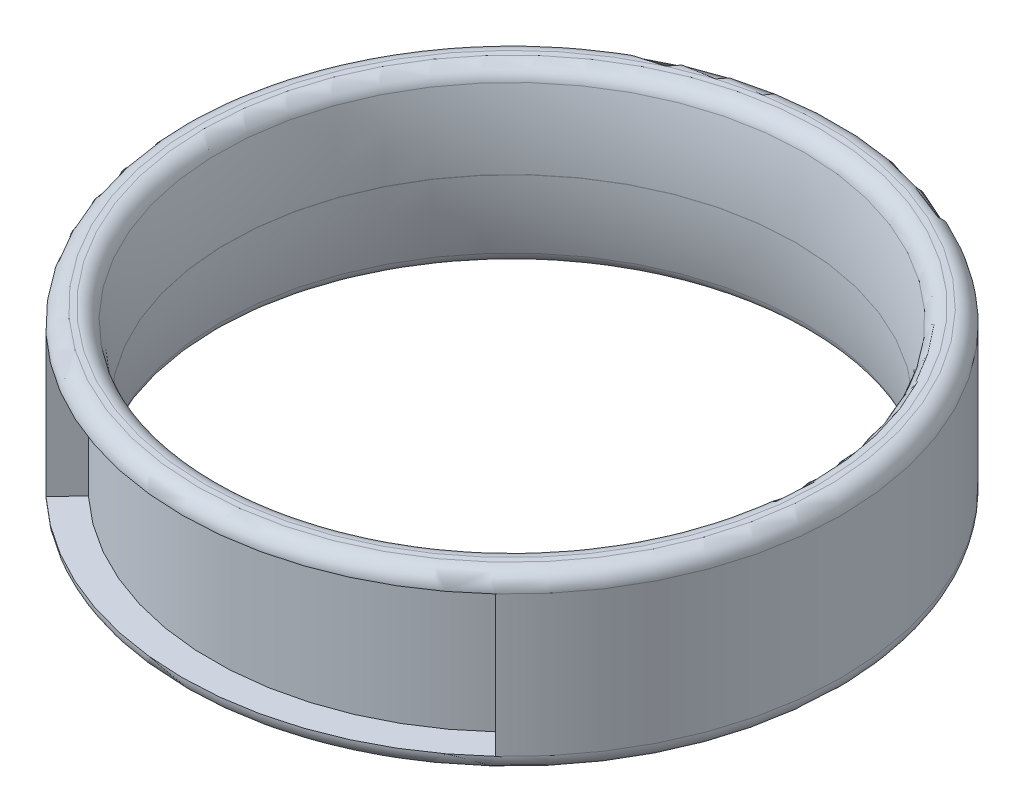
ISO-10303-21;
HEADER;
FILE_DESCRIPTION(('STEP AP214'),'2;1');
FILE_NAME('part.step','',(''),(''),'','','');
FILE_SCHEMA(('AUTOMOTIVE_DESIGN { 1 0 10303 214 1 1 1 1 }'));
ENDSEC;
DATA;
#1=APPLICATION_CONTEXT('core data for automotive mechanical design processes');
#2=APPLICATION_PROTOCOL_DEFINITION('international standard','automotive_design',2000,#1);
#3=PRODUCT_CONTEXT('',#1,'mechanical');
#4=PRODUCT('Part','Part','',(#3));
#5=PRODUCT_RELATED_PRODUCT_CATEGORY('part','',(#4));
#6=PRODUCT_DEFINITION_FORMATION('','',#4);
#7=PRODUCT_DEFINITION_CONTEXT('part definition',#1,'design');
#8=PRODUCT_DEFINITION('design','',#6,#7);
#9=PRODUCT_DEFINITION_SHAPE('','',#8);
#10=(LENGTH_UNIT() NAMED_UNIT(*) SI_UNIT(.MILLI.,.METRE.));
#11=(NAMED_UNIT(*) PLANE_ANGLE_UNIT() SI_UNIT($,.RADIAN.));
#12=(NAMED_UNIT(*) SI_UNIT($,.STERADIAN.) SOLID_ANGLE_UNIT());
#13=UNCERTAINTY_MEASURE_WITH_UNIT(LENGTH_MEASURE(1.E-05),#10,'distance_accuracy_value','');
#14=(GEOMETRIC_REPRESENTATION_CONTEXT(3) GLOBAL_UNCERTAINTY_ASSIGNED_CONTEXT((#13)) GLOBAL_UNIT_ASSIGNED_CONTEXT((#10,
#11,#12)) REPRESENTATION_CONTEXT('',''));
#15=CARTESIAN_POINT('',(0.,0.,0.));
#16=DIRECTION('',(0.,0.,1.));
#17=DIRECTION('',(1.,0.,0.));
#18=AXIS2_PLACEMENT_3D('',#15,#16,#17);
#19=CARTESIAN_POINT('',(0.,-3.75,0.));
#20=DIRECTION('',(0.,1.,0.));
#21=DIRECTION('',(0.,0.,1.));
#22=AXIS2_PLACEMENT_3D('',#19,#20,#21);
#23=CYLINDRICAL_SURFACE('',#22,14.3);
#24=CARTESIAN_POINT('',(0.,-3.05,0.));
#25=DIRECTION('',(0.,1.,0.));
#26=DIRECTION('',(0.,0.,1.));
#27=AXIS2_PLACEMENT_3D('',#24,#25,#26);
#28=CIRCLE('',#27,14.3);
#29=CARTESIAN_POINT('',(-9.75257654889375,-3.05,-10.4583579331541));
#30=VERTEX_POINT('',#29);
#31=CARTESIAN_POINT('',(-9.75257654889375,-3.05,10.4583579331541));
#32=VERTEX_POINT('',#31);
#33=EDGE_CURVE('E168',#30,#32,#28,.T.);
#34=ORIENTED_EDGE('',*,*,#33,.T.);
#35=DIRECTION('',(0.,1.,0.));
#36=VECTOR('',#35,1.);
#37=CARTESIAN_POINT('',(-9.75257654889375,3.05,10.4583579331541));
#38=LINE('',#37,#36);
#39=CARTESIAN_POINT('',(-9.75257654889375,3.05,10.4583579331541));
#40=VERTEX_POINT('',#39);
#41=EDGE_CURVE('E235',#32,#40,#38,.T.);
#42=ORIENTED_EDGE('',*,*,#41,.T.);
#43=CARTESIAN_POINT('',(0.,3.05,0.));
#44=DIRECTION('',(0.,1.,0.));
#45=DIRECTION('',(0.,0.,1.));
#46=AXIS2_PLACEMENT_3D('',#43,#44,#45);
#47=CIRCLE('',#46,14.3);
#48=CARTESIAN_POINT('',(-9.75257654889375,3.05,-10.4583579331541));
#49=VERTEX_POINT('',#48);
#50=EDGE_CURVE('E58',#40,#49,#47,.F.);
#51=ORIENTED_EDGE('',*,*,#50,.T.);
#52=DIRECTION('',(0.,1.,0.));
#53=VECTOR('',#52,1.);
#54=CARTESIAN_POINT('',(-9.75257654889375,3.05,-10.4583579331541));
#55=LINE('',#54,#53);
#56=EDGE_CURVE('E137',#30,#49,#55,.T.);
#57=ORIENTED_EDGE('',*,*,#56,.F.);
#58=EDGE_LOOP('',(#34,#42,#51,#57));
#59=FACE_BOUND('',#58,.T.);
#60=ADVANCED_FACE('F35',(#59),#23,.T.);
#61=CARTESIAN_POINT('',(0.,-3.75,0.));
#62=DIRECTION('',(0.,1.,0.));
#63=DIRECTION('',(0.,0.,1.));
#64=AXIS2_PLACEMENT_3D('',#61,#62,#63);
#65=CYLINDRICAL_SURFACE('',#64,12.3);
#66=CARTESIAN_POINT('',(0.,0.0049999999999998,0.));
#67=DIRECTION('',(0.,-1.,0.));
#68=DIRECTION('',(0.,0.,-1.));
#69=AXIS2_PLACEMENT_3D('',#66,#67,#68);
#70=CIRCLE('',#69,12.3);
#71=CARTESIAN_POINT('',(0.,0.0049999999999998,-12.3));
#72=VERTEX_POINT('',#71);
#73=EDGE_CURVE('E158',#72,#72,#70,.T.);
#74=ORIENTED_EDGE('',*,*,#73,.F.);
#75=EDGE_LOOP('',(#74));
#76=FACE_BOUND('',#75,.T.);
#77=CARTESIAN_POINT('',(0.,-0.00500000000000003,0.));
#78=DIRECTION('',(0.,-1.,0.));
#79=DIRECTION('',(0.,0.,-1.));
#80=AXIS2_PLACEMENT_3D('',#77,#78,#79);
#81=CIRCLE('',#80,12.3);
#82=CARTESIAN_POINT('',(0.,-0.00500000000000003,-12.3));
#83=VERTEX_POINT('',#82);
#84=EDGE_CURVE('E155',#83,#83,#81,.T.);
#85=ORIENTED_EDGE('',*,*,#84,.T.);
#86=EDGE_LOOP('',(#85));
#87=FACE_BOUND('',#86,.T.);
#88=ADVANCED_FACE('F200',(#76,#87),#65,.F.);
#89=CARTESIAN_POINT('',(0.,-3.75,0.));
#90=DIRECTION('',(0.,1.,0.));
#91=DIRECTION('',(0.,0.,1.));
#92=AXIS2_PLACEMENT_3D('',#89,#90,#91);
#93=PLANE('',#92);
#94=CARTESIAN_POINT('',(0.,-3.75,0.));
#95=DIRECTION('',(0.,1.,0.));
#96=DIRECTION('',(0.,0.,1.));
#97=AXIS2_PLACEMENT_3D('',#94,#95,#96);
#98=CIRCLE('',#97,13.3490821675976);
#99=CARTESIAN_POINT('',(0.,-3.75,13.3490821675976));
#100=VERTEX_POINT('',#99);
#101=EDGE_CURVE('E177',#100,#100,#98,.T.);
#102=ORIENTED_EDGE('',*,*,#101,.T.);
#103=EDGE_LOOP('',(#102));
#104=FACE_BOUND('',#103,.T.);
#105=CARTESIAN_POINT('',(0.,-3.75,0.));
#106=DIRECTION('',(0.,1.,0.));
#107=DIRECTION('',(0.,0.,1.));
#108=AXIS2_PLACEMENT_3D('',#105,#106,#107);
#109=CIRCLE('',#108,13.6);
#110=CARTESIAN_POINT('',(0.,-3.75,13.6));
#111=VERTEX_POINT('',#110);
#112=EDGE_CURVE('E167',#111,#111,#109,.F.);
#113=ORIENTED_EDGE('',*,*,#112,.T.);
#114=EDGE_LOOP('',(#113));
#115=FACE_BOUND('',#114,.T.);
#116=ADVANCED_FACE('F206',(#104,#115),#93,.F.);
#117=CARTESIAN_POINT('',(0.,3.75,0.));
#118=DIRECTION('',(0.,1.,0.));
#119=DIRECTION('',(0.,0.,1.));
#120=AXIS2_PLACEMENT_3D('',#117,#118,#119);
#121=PLANE('',#120);
#122=CARTESIAN_POINT('',(0.,3.75,0.));
#123=DIRECTION('',(0.,1.,0.));
#124=DIRECTION('',(0.,0.,1.));
#125=AXIS2_PLACEMENT_3D('',#122,#123,#124);
#126=CIRCLE('',#125,13.3490821675976);
#127=CARTESIAN_POINT('',(0.,3.75,13.3490821675976));
#128=VERTEX_POINT('',#127);
#129=EDGE_CURVE('E43',#128,#128,#126,.F.);
#130=ORIENTED_EDGE('',*,*,#129,.T.);
#131=EDGE_LOOP('',(#130));
#132=FACE_BOUND('',#131,.T.);
#133=CARTESIAN_POINT('',(0.,3.75,0.));
#134=DIRECTION('',(0.,1.,0.));
#135=DIRECTION('',(0.,0.,1.));
#136=AXIS2_PLACEMENT_3D('',#133,#134,#135);
#137=CIRCLE('',#136,13.6);
#138=CARTESIAN_POINT('',(0.,3.75,13.6));
#139=VERTEX_POINT('',#138);
#140=EDGE_CURVE('E171',#139,#139,#137,.T.);
#141=ORIENTED_EDGE('',*,*,#140,.T.);
#142=EDGE_LOOP('',(#141));
#143=FACE_BOUND('',#142,.T.);
#144=ADVANCED_FACE('F182',(#132,#143),#121,.T.);
#145=DIRECTION('',(0.,1.,0.));
#146=VECTOR('',#145,1.);
#147=CARTESIAN_POINT('',(9.75257654889375,3.05,10.4583579331541));
#148=LINE('',#147,#146);
#149=CARTESIAN_POINT('',(9.75257654889375,-3.05,10.4583579331541));
#150=VERTEX_POINT('',#149);
#151=CARTESIAN_POINT('',(9.75257654889375,3.05,10.4583579331541));
#152=VERTEX_POINT('',#151);
#153=EDGE_CURVE('E224',#150,#152,#148,.T.);
#154=ORIENTED_EDGE('',*,*,#153,.F.);
#155=CARTESIAN_POINT('',(9.75257654889375,-3.05,-10.4583579331541));
#156=VERTEX_POINT('',#155);
#157=EDGE_CURVE('E163',#150,#156,#28,.T.);
#158=ORIENTED_EDGE('',*,*,#157,.T.);
#159=DIRECTION('',(0.,1.,0.));
#160=VECTOR('',#159,1.);
#161=CARTESIAN_POINT('',(9.75257654889375,3.05,-10.4583579331541));
#162=LINE('',#161,#160);
#163=CARTESIAN_POINT('',(9.75257654889375,3.05,-10.4583579331541));
#164=VERTEX_POINT('',#163);
#165=EDGE_CURVE('E148',#156,#164,#162,.T.);
#166=ORIENTED_EDGE('',*,*,#165,.T.);
#167=EDGE_CURVE('E164',#164,#152,#47,.F.);
#168=ORIENTED_EDGE('',*,*,#167,.T.);
#169=EDGE_LOOP('',(#154,#158,#166,#168));
#170=FACE_BOUND('',#169,.T.);
#171=ADVANCED_FACE('F202',(#170),#23,.T.);
#172=CARTESIAN_POINT('',(0.,-3.05,0.));
#173=DIRECTION('',(0.,1.,0.));
#174=DIRECTION('',(0.,0.,1.));
#175=AXIS2_PLACEMENT_3D('',#172,#173,#174);
#176=TOROIDAL_SURFACE('',#175,13.6,0.7);
#177=ORIENTED_EDGE('',*,*,#112,.F.);
#178=EDGE_LOOP('',(#177));
#179=FACE_BOUND('',#178,.T.);
#180=EDGE_CURVE('E165',#156,#30,#28,.T.);
#181=ORIENTED_EDGE('',*,*,#180,.F.);
#182=ORIENTED_EDGE('',*,*,#157,.F.);
#183=CARTESIAN_POINT('',(0.,-3.05,0.));
#184=DIRECTION('',(0.,-1.,0.));
#185=DIRECTION('',(0.,0.,-1.));
#186=AXIS2_PLACEMENT_3D('',#183,#184,#185);
#187=CIRCLE('',#186,14.3);
#188=EDGE_CURVE('E128',#150,#32,#187,.T.);
#189=ORIENTED_EDGE('',*,*,#188,.T.);
#190=ORIENTED_EDGE('',*,*,#33,.F.);
#191=EDGE_LOOP('',(#181,#182,#189,#190));
#192=FACE_BOUND('',#191,.T.);
#193=ADVANCED_FACE('F213',(#179,#192),#176,.T.);
#194=CARTESIAN_POINT('',(0.,3.05,0.));
#195=DIRECTION('',(0.,1.,0.));
#196=DIRECTION('',(0.,0.,1.));
#197=AXIS2_PLACEMENT_3D('',#194,#195,#196);
#198=TOROIDAL_SURFACE('',#197,13.6,0.7);
#199=EDGE_CURVE('E161',#49,#164,#47,.F.);
#200=ORIENTED_EDGE('',*,*,#199,.F.);
#201=ORIENTED_EDGE('',*,*,#50,.F.);
#202=CARTESIAN_POINT('',(0.,3.05,0.));
#203=DIRECTION('',(0.,-1.,0.));
#204=DIRECTION('',(0.,0.,-1.));
#205=AXIS2_PLACEMENT_3D('',#202,#203,#204);
#206=CIRCLE('',#205,14.3);
#207=EDGE_CURVE('E117',#152,#40,#206,.T.);
#208=ORIENTED_EDGE('',*,*,#207,.F.);
#209=ORIENTED_EDGE('',*,*,#167,.F.);
#210=EDGE_LOOP('',(#200,#201,#208,#209));
#211=FACE_BOUND('',#210,.T.);
#212=ORIENTED_EDGE('',*,*,#140,.F.);
#213=EDGE_LOOP('',(#212));
#214=FACE_BOUND('',#213,.T.);
#215=ADVANCED_FACE('F219',(#211,#214),#198,.T.);
#216=CARTESIAN_POINT('',(0.,-0.0917507307465074,0.));
#217=DIRECTION('',(0.,-1.,0.));
#218=DIRECTION('',(0.,0.,-1.));
#219=AXIS2_PLACEMENT_3D('',#216,#217,#218);
#220=TOROIDAL_SURFACE('',#219,27.2996879732913,15.);
#221=CARTESIAN_POINT('',(0.,3.20379199381277,0.));
#222=DIRECTION('',(0.,-1.,0.));
#223=DIRECTION('',(0.,0.,-1.));
#224=AXIS2_PLACEMENT_3D('',#221,#222,#223);
#225=CIRCLE('',#224,12.6661853799064);
#226=CARTESIAN_POINT('',(0.,3.20379199381277,-12.6661853799064));
#227=VERTEX_POINT('',#226);
#228=EDGE_CURVE('E11',#227,#227,#225,.F.);
#229=ORIENTED_EDGE('',*,*,#228,.T.);
#230=EDGE_LOOP('',(#229));
#231=FACE_BOUND('',#230,.T.);
#232=ORIENTED_EDGE('',*,*,#73,.T.);
#233=EDGE_LOOP('',(#232));
#234=FACE_BOUND('',#233,.T.);
#235=ADVANCED_FACE('F282',(#231,#234),#220,.T.);
#236=CARTESIAN_POINT('',(0.,0.091750730746503,0.));
#237=DIRECTION('',(0.,-1.,0.));
#238=DIRECTION('',(0.,0.,-1.));
#239=AXIS2_PLACEMENT_3D('',#236,#237,#238);
#240=TOROIDAL_SURFACE('',#239,27.2996879732913,15.);
#241=CARTESIAN_POINT('',(0.,-3.20379199381276,0.));
#242=DIRECTION('',(0.,1.,0.));
#243=DIRECTION('',(0.,0.,1.));
#244=AXIS2_PLACEMENT_3D('',#241,#242,#243);
#245=CIRCLE('',#244,12.6661853799064);
#246=CARTESIAN_POINT('',(0.,-3.20379199381276,12.6661853799064));
#247=VERTEX_POINT('',#246);
#248=EDGE_CURVE('E174',#247,#247,#245,.F.);
#249=ORIENTED_EDGE('',*,*,#248,.T.);
#250=EDGE_LOOP('',(#249));
#251=FACE_BOUND('',#250,.T.);
#252=ORIENTED_EDGE('',*,*,#84,.F.);
#253=EDGE_LOOP('',(#252));
#254=FACE_BOUND('',#253,.T.);
#255=ADVANCED_FACE('F196',(#251,#254),#240,.T.);
#256=CARTESIAN_POINT('',(0.,-3.05,0.));
#257=DIRECTION('',(0.,-1.,0.));
#258=DIRECTION('',(0.,0.,-1.));
#259=AXIS2_PLACEMENT_3D('',#256,#257,#258);
#260=TOROIDAL_SURFACE('',#259,13.3490821675976,0.7);
#261=ORIENTED_EDGE('',*,*,#101,.F.);
#262=EDGE_LOOP('',(#261));
#263=FACE_BOUND('',#262,.T.);
#264=ORIENTED_EDGE('',*,*,#248,.F.);
#265=EDGE_LOOP('',(#264));
#266=FACE_BOUND('',#265,.T.);
#267=ADVANCED_FACE('F187',(#263,#266),#260,.T.);
#268=CARTESIAN_POINT('',(0.,3.05,0.));
#269=DIRECTION('',(0.,-1.,0.));
#270=DIRECTION('',(0.,0.,-1.));
#271=AXIS2_PLACEMENT_3D('',#268,#269,#270);
#272=TOROIDAL_SURFACE('',#271,13.3490821675976,0.7);
#273=ORIENTED_EDGE('',*,*,#228,.F.);
#274=EDGE_LOOP('',(#273));
#275=FACE_BOUND('',#274,.T.);
#276=ORIENTED_EDGE('',*,*,#129,.F.);
#277=EDGE_LOOP('',(#276));
#278=FACE_BOUND('',#277,.T.);
#279=ADVANCED_FACE('F37',(#275,#278),#272,.T.);
#280=CARTESIAN_POINT('',(9.75257654889375,3.05,-10.4583579331541));
#281=DIRECTION('',(0.,-1.,0.));
#282=DIRECTION('',(0.,0.,-1.));
#283=AXIS2_PLACEMENT_3D('',#280,#281,#282);
#284=PLANE('',#283);
#285=CARTESIAN_POINT('',(0.,3.05,0.));
#286=DIRECTION('',(0.,1.,0.));
#287=DIRECTION('',(0.,0.,1.));
#288=AXIS2_PLACEMENT_3D('',#285,#286,#287);
#289=CIRCLE('',#288,13.);
#290=CARTESIAN_POINT('',(8.8659786808125,3.05,-9.5075981210492));
#291=VERTEX_POINT('',#290);
#292=CARTESIAN_POINT('',(-8.8659786808125,3.05,-9.5075981210492));
#293=VERTEX_POINT('',#292);
#294=EDGE_CURVE('E153',#291,#293,#289,.T.);
#295=ORIENTED_EDGE('',*,*,#294,.T.);
#296=DIRECTION('',(0.6819983600625,0.,0.731353701619169));
#297=VECTOR('',#296,1.);
#298=CARTESIAN_POINT('',(-9.75257654889375,3.05,-10.4583579331541));
#299=LINE('',#298,#297);
#300=EDGE_CURVE('E122',#49,#293,#299,.T.);
#301=ORIENTED_EDGE('',*,*,#300,.F.);
#302=ORIENTED_EDGE('',*,*,#199,.T.);
#303=DIRECTION('',(-0.6819983600625,0.,0.731353701619169));
#304=VECTOR('',#303,1.);
#305=CARTESIAN_POINT('',(9.75257654889375,3.05,-10.4583579331541));
#306=LINE('',#305,#304);
#307=EDGE_CURVE('E139',#164,#291,#306,.T.);
#308=ORIENTED_EDGE('',*,*,#307,.T.);
#309=EDGE_LOOP('',(#295,#301,#302,#308));
#310=FACE_BOUND('',#309,.T.);
#311=ADVANCED_FACE('F186',(#310),#284,.T.);
#312=CARTESIAN_POINT('',(0.,0.,0.));
#313=DIRECTION('',(0.,1.,0.));
#314=DIRECTION('',(0.,0.,1.));
#315=AXIS2_PLACEMENT_3D('',#312,#313,#314);
#316=CYLINDRICAL_SURFACE('',#315,13.);
#317=CARTESIAN_POINT('',(0.,-3.05,0.));
#318=DIRECTION('',(0.,1.,0.));
#319=DIRECTION('',(0.,0.,1.));
#320=AXIS2_PLACEMENT_3D('',#317,#318,#319);
#321=CIRCLE('',#320,13.);
#322=CARTESIAN_POINT('',(8.8659786808125,-3.05,-9.5075981210492));
#323=VERTEX_POINT('',#322);
#324=CARTESIAN_POINT('',(-8.8659786808125,-3.05,-9.5075981210492));
#325=VERTEX_POINT('',#324);
#326=EDGE_CURVE('E151',#323,#325,#321,.T.);
#327=ORIENTED_EDGE('',*,*,#326,.T.);
#328=DIRECTION('',(0.,-1.,0.));
#329=VECTOR('',#328,1.);
#330=CARTESIAN_POINT('',(-8.8659786808125,3.05,-9.5075981210492));
#331=LINE('',#330,#329);
#332=EDGE_CURVE('E126',#293,#325,#331,.T.);
#333=ORIENTED_EDGE('',*,*,#332,.F.);
#334=ORIENTED_EDGE('',*,*,#294,.F.);
#335=DIRECTION('',(0.,-1.,0.));
#336=VECTOR('',#335,1.);
#337=CARTESIAN_POINT('',(8.8659786808125,3.05,-9.5075981210492));
#338=LINE('',#337,#336);
#339=EDGE_CURVE('E142',#291,#323,#338,.T.);
#340=ORIENTED_EDGE('',*,*,#339,.T.);
#341=EDGE_LOOP('',(#327,#333,#334,#340));
#342=FACE_BOUND('',#341,.T.);
#343=ADVANCED_FACE('F193',(#342),#316,.T.);
#344=CARTESIAN_POINT('',(9.75257654889375,-3.05,-10.4583579331541));
#345=DIRECTION('',(0.,1.,0.));
#346=DIRECTION('',(0.,0.,1.));
#347=AXIS2_PLACEMENT_3D('',#344,#345,#346);
#348=PLANE('',#347);
#349=ORIENTED_EDGE('',*,*,#180,.T.);
#350=DIRECTION('',(-0.6819983600625,0.,-0.731353701619169));
#351=VECTOR('',#350,1.);
#352=CARTESIAN_POINT('',(-9.75257654889375,-3.05,-10.4583579331541));
#353=LINE('',#352,#351);
#354=EDGE_CURVE('E134',#325,#30,#353,.T.);
#355=ORIENTED_EDGE('',*,*,#354,.F.);
#356=ORIENTED_EDGE('',*,*,#326,.F.);
#357=DIRECTION('',(0.6819983600625,0.,-0.731353701619169));
#358=VECTOR('',#357,1.);
#359=CARTESIAN_POINT('',(9.75257654889375,-3.05,-10.4583579331541));
#360=LINE('',#359,#358);
#361=EDGE_CURVE('E145',#323,#156,#360,.T.);
#362=ORIENTED_EDGE('',*,*,#361,.T.);
#363=EDGE_LOOP('',(#349,#355,#356,#362));
#364=FACE_BOUND('',#363,.T.);
#365=ADVANCED_FACE('F271',(#364),#348,.T.);
#366=CARTESIAN_POINT('',(0.,0.,0.));
#367=DIRECTION('',(0.731353701619169,0.,0.6819983600625));
#368=DIRECTION('',(0.6819983600625,0.,-0.731353701619169));
#369=AXIS2_PLACEMENT_3D('',#366,#367,#368);
#370=PLANE('',#369);
#371=ORIENTED_EDGE('',*,*,#307,.F.);
#372=ORIENTED_EDGE('',*,*,#165,.F.);
#373=ORIENTED_EDGE('',*,*,#361,.F.);
#374=ORIENTED_EDGE('',*,*,#339,.F.);
#375=EDGE_LOOP('',(#371,#372,#373,#374));
#376=FACE_BOUND('',#375,.T.);
#377=ADVANCED_FACE('F269',(#376),#370,.F.);
#378=CARTESIAN_POINT('',(0.,0.,0.));
#379=DIRECTION('',(0.731353701619169,0.,-0.6819983600625));
#380=DIRECTION('',(-0.6819983600625,0.,-0.731353701619169));
#381=AXIS2_PLACEMENT_3D('',#378,#379,#380);
#382=PLANE('',#381);
#383=ORIENTED_EDGE('',*,*,#300,.T.);
#384=ORIENTED_EDGE('',*,*,#332,.T.);
#385=ORIENTED_EDGE('',*,*,#354,.T.);
#386=ORIENTED_EDGE('',*,*,#56,.T.);
#387=EDGE_LOOP('',(#383,#384,#385,#386));
#388=FACE_BOUND('',#387,.T.);
#389=ADVANCED_FACE('F238',(#388),#382,.T.);
#390=CARTESIAN_POINT('',(9.75257654889375,3.05,10.4583579331541));
#391=DIRECTION('',(0.,-1.,0.));
#392=DIRECTION('',(0.,0.,1.));
#393=AXIS2_PLACEMENT_3D('',#390,#391,#392);
#394=PLANE('',#393);
#395=CARTESIAN_POINT('',(0.,3.05,0.));
#396=DIRECTION('',(0.,-1.,0.));
#397=DIRECTION('',(0.,0.,-1.));
#398=AXIS2_PLACEMENT_3D('',#395,#396,#397);
#399=CIRCLE('',#398,13.);
#400=CARTESIAN_POINT('',(8.8659786808125,3.05,9.5075981210492));
#401=VERTEX_POINT('',#400);
#402=CARTESIAN_POINT('',(-8.8659786808125,3.05,9.5075981210492));
#403=VERTEX_POINT('',#402);
#404=EDGE_CURVE('E115',#401,#403,#399,.T.);
#405=ORIENTED_EDGE('',*,*,#404,.F.);
#406=DIRECTION('',(-0.6819983600625,0.,-0.731353701619169));
#407=VECTOR('',#406,1.);
#408=CARTESIAN_POINT('',(9.75257654889375,3.05,10.4583579331541));
#409=LINE('',#408,#407);
#410=EDGE_CURVE('E50',#152,#401,#409,.T.);
#411=ORIENTED_EDGE('',*,*,#410,.F.);
#412=ORIENTED_EDGE('',*,*,#207,.T.);
#413=DIRECTION('',(0.6819983600625,0.,-0.731353701619169));
#414=VECTOR('',#413,1.);
#415=CARTESIAN_POINT('',(-9.75257654889375,3.05,10.4583579331541));
#416=LINE('',#415,#414);
#417=EDGE_CURVE('E106',#40,#403,#416,.T.);
#418=ORIENTED_EDGE('',*,*,#417,.T.);
#419=EDGE_LOOP('',(#405,#411,#412,#418));
#420=FACE_BOUND('',#419,.T.);
#421=ADVANCED_FACE('F114',(#420),#394,.T.);
#422=CARTESIAN_POINT('',(0.,0.,0.));
#423=DIRECTION('',(0.,1.,0.));
#424=DIRECTION('',(0.,0.,-1.));
#425=AXIS2_PLACEMENT_3D('',#422,#423,#424);
#426=CYLINDRICAL_SURFACE('',#425,13.);
#427=CARTESIAN_POINT('',(0.,-3.05,0.));
#428=DIRECTION('',(0.,-1.,0.));
#429=DIRECTION('',(0.,0.,-1.));
#430=AXIS2_PLACEMENT_3D('',#427,#428,#429);
#431=CIRCLE('',#430,13.);
#432=CARTESIAN_POINT('',(8.8659786808125,-3.05,9.5075981210492));
#433=VERTEX_POINT('',#432);
#434=CARTESIAN_POINT('',(-8.8659786808125,-3.05,9.5075981210492));
#435=VERTEX_POINT('',#434);
#436=EDGE_CURVE('E123',#433,#435,#431,.T.);
#437=ORIENTED_EDGE('',*,*,#436,.F.);
#438=DIRECTION('',(0.,-1.,0.));
#439=VECTOR('',#438,1.);
#440=CARTESIAN_POINT('',(8.8659786808125,3.05,9.5075981210492));
#441=LINE('',#440,#439);
#442=EDGE_CURVE('E121',#401,#433,#441,.T.);
#443=ORIENTED_EDGE('',*,*,#442,.F.);
#444=ORIENTED_EDGE('',*,*,#404,.T.);
#445=DIRECTION('',(0.,-1.,0.));
#446=VECTOR('',#445,1.);
#447=CARTESIAN_POINT('',(-8.8659786808125,3.05,9.5075981210492));
#448=LINE('',#447,#446);
#449=EDGE_CURVE('E103',#403,#435,#448,.T.);
#450=ORIENTED_EDGE('',*,*,#449,.T.);
#451=EDGE_LOOP('',(#437,#443,#444,#450));
#452=FACE_BOUND('',#451,.T.);
#453=ADVANCED_FACE('F119',(#452),#426,.T.);
#454=CARTESIAN_POINT('',(9.75257654889375,-3.05,10.4583579331541));
#455=DIRECTION('',(0.,1.,0.));
#456=DIRECTION('',(0.,0.,-1.));
#457=AXIS2_PLACEMENT_3D('',#454,#455,#456);
#458=PLANE('',#457);
#459=ORIENTED_EDGE('',*,*,#188,.F.);
#460=DIRECTION('',(0.6819983600625,0.,0.731353701619169));
#461=VECTOR('',#460,1.);
#462=CARTESIAN_POINT('',(9.75257654889375,-3.05,10.4583579331541));
#463=LINE('',#462,#461);
#464=EDGE_CURVE('E228',#433,#150,#463,.T.);
#465=ORIENTED_EDGE('',*,*,#464,.F.);
#466=ORIENTED_EDGE('',*,*,#436,.T.);
#467=DIRECTION('',(-0.6819983600625,0.,0.731353701619169));
#468=VECTOR('',#467,1.);
#469=CARTESIAN_POINT('',(-9.75257654889375,-3.05,10.4583579331541));
#470=LINE('',#469,#468);
#471=EDGE_CURVE('E108',#435,#32,#470,.T.);
#472=ORIENTED_EDGE('',*,*,#471,.T.);
#473=EDGE_LOOP('',(#459,#465,#466,#472));
#474=FACE_BOUND('',#473,.T.);
#475=ADVANCED_FACE('F252',(#474),#458,.T.);
#476=CARTESIAN_POINT('',(0.,0.,0.));
#477=DIRECTION('',(0.731353701619169,0.,-0.6819983600625));
#478=DIRECTION('',(0.6819983600625,0.,0.731353701619169));
#479=AXIS2_PLACEMENT_3D('',#476,#477,#478);
#480=PLANE('',#479);
#481=ORIENTED_EDGE('',*,*,#410,.T.);
#482=ORIENTED_EDGE('',*,*,#442,.T.);
#483=ORIENTED_EDGE('',*,*,#464,.T.);
#484=ORIENTED_EDGE('',*,*,#153,.T.);
#485=EDGE_LOOP('',(#481,#482,#483,#484));
#486=FACE_BOUND('',#485,.T.);
#487=ADVANCED_FACE('F253',(#486),#480,.F.);
#488=CARTESIAN_POINT('',(0.,0.,0.));
#489=DIRECTION('',(0.731353701619169,0.,0.6819983600625));
#490=DIRECTION('',(-0.6819983600625,0.,0.731353701619169));
#491=AXIS2_PLACEMENT_3D('',#488,#489,#490);
#492=PLANE('',#491);
#493=ORIENTED_EDGE('',*,*,#417,.F.);
#494=ORIENTED_EDGE('',*,*,#41,.F.);
#495=ORIENTED_EDGE('',*,*,#471,.F.);
#496=ORIENTED_EDGE('',*,*,#449,.F.);
#497=EDGE_LOOP('',(#493,#494,#495,#496));
#498=FACE_BOUND('',#497,.T.);
#499=ADVANCED_FACE('F105',(#498),#492,.T.);
#500=CLOSED_SHELL('',(#60,#88,#116,#144,#171,#193,#215,#235,#255,#267,#279,#311,#343,#365,#377,
#389,#421,#453,#475,#487,#499));
#501=MANIFOLD_SOLID_BREP('B2',#500);
#502=ADVANCED_BREP_SHAPE_REPRESENTATION('',(#18,#501),#14);
#503=SHAPE_DEFINITION_REPRESENTATION(#9,#502);
ENDSEC;
END-ISO-10303-21;
